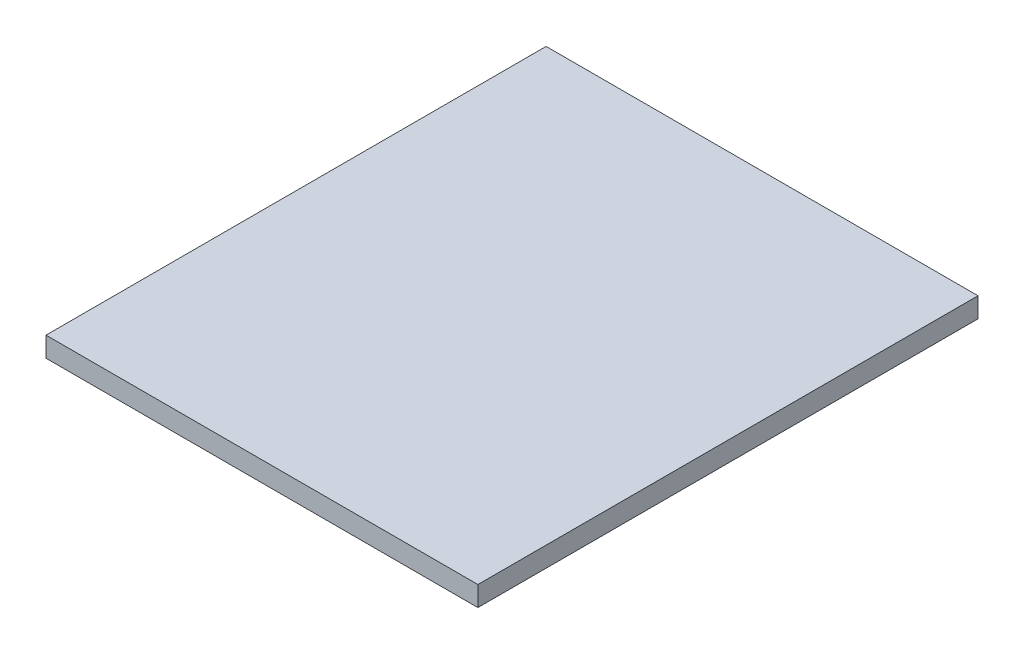
ISO-10303-21;
HEADER;
FILE_DESCRIPTION(('STEP AP214'),'2;1');
FILE_NAME('part.step','',(''),(''),'','','');
FILE_SCHEMA(('AUTOMOTIVE_DESIGN { 1 0 10303 214 1 1 1 1 }'));
ENDSEC;
DATA;
#1=APPLICATION_CONTEXT('core data for automotive mechanical design processes');
#2=APPLICATION_PROTOCOL_DEFINITION('international standard','automotive_design',2000,#1);
#3=PRODUCT_CONTEXT('',#1,'mechanical');
#4=PRODUCT('Part','Part','',(#3));
#5=PRODUCT_RELATED_PRODUCT_CATEGORY('part','',(#4));
#6=PRODUCT_DEFINITION_FORMATION('','',#4);
#7=PRODUCT_DEFINITION_CONTEXT('part definition',#1,'design');
#8=PRODUCT_DEFINITION('design','',#6,#7);
#9=PRODUCT_DEFINITION_SHAPE('','',#8);
#10=(LENGTH_UNIT() NAMED_UNIT(*) SI_UNIT(.MILLI.,.METRE.));
#11=(NAMED_UNIT(*) PLANE_ANGLE_UNIT() SI_UNIT($,.RADIAN.));
#12=(NAMED_UNIT(*) SI_UNIT($,.STERADIAN.) SOLID_ANGLE_UNIT());
#13=UNCERTAINTY_MEASURE_WITH_UNIT(LENGTH_MEASURE(1.E-05),#10,'distance_accuracy_value','');
#14=(GEOMETRIC_REPRESENTATION_CONTEXT(3) GLOBAL_UNCERTAINTY_ASSIGNED_CONTEXT((#13)) GLOBAL_UNIT_ASSIGNED_CONTEXT((#10,
#11,#12)) REPRESENTATION_CONTEXT('',''));
#15=CARTESIAN_POINT('',(0.,0.,0.));
#16=DIRECTION('',(0.,0.,1.));
#17=DIRECTION('',(1.,0.,0.));
#18=AXIS2_PLACEMENT_3D('',#15,#16,#17);
#19=CARTESIAN_POINT('',(215.9,0.,0.));
#20=DIRECTION('',(0.,0.,-1.));
#21=DIRECTION('',(0.,1.,0.));
#22=AXIS2_PLACEMENT_3D('',#19,#20,#21);
#23=PLANE('',#22);
#24=DIRECTION('',(0.,-1.,0.));
#25=VECTOR('',#24,1.);
#26=CARTESIAN_POINT('',(-215.9,0.,0.));
#27=LINE('',#26,#25);
#28=CARTESIAN_POINT('',(-215.9,0.,0.));
#29=VERTEX_POINT('',#28);
#30=CARTESIAN_POINT('',(-215.9,-20.,0.));
#31=VERTEX_POINT('',#30);
#32=EDGE_CURVE('E97',#29,#31,#27,.T.);
#33=ORIENTED_EDGE('',*,*,#32,.F.);
#34=DIRECTION('',(-1.,0.,0.));
#35=VECTOR('',#34,1.);
#36=CARTESIAN_POINT('',(215.9,0.,0.));
#37=LINE('',#36,#35);
#38=CARTESIAN_POINT('',(215.9,0.,0.));
#39=VERTEX_POINT('',#38);
#40=EDGE_CURVE('E11',#39,#29,#37,.T.);
#41=ORIENTED_EDGE('',*,*,#40,.F.);
#42=DIRECTION('',(0.,-1.,0.));
#43=VECTOR('',#42,1.);
#44=CARTESIAN_POINT('',(215.9,0.,0.));
#45=LINE('',#44,#43);
#46=CARTESIAN_POINT('',(215.9,-20.,0.));
#47=VERTEX_POINT('',#46);
#48=EDGE_CURVE('E92',#39,#47,#45,.T.);
#49=ORIENTED_EDGE('',*,*,#48,.T.);
#50=DIRECTION('',(-1.,0.,0.));
#51=VECTOR('',#50,1.);
#52=CARTESIAN_POINT('',(215.9,-20.,0.));
#53=LINE('',#52,#51);
#54=EDGE_CURVE('E35',#47,#31,#53,.T.);
#55=ORIENTED_EDGE('',*,*,#54,.T.);
#56=EDGE_LOOP('',(#33,#41,#49,#55));
#57=FACE_BOUND('',#56,.T.);
#58=ADVANCED_FACE('F32',(#57),#23,.T.);
#59=CARTESIAN_POINT('',(215.9,0.,0.));
#60=DIRECTION('',(0.,-1.,0.));
#61=DIRECTION('',(0.,0.,-1.));
#62=AXIS2_PLACEMENT_3D('',#59,#60,#61);
#63=PLANE('',#62);
#64=DIRECTION('',(0.,0.,1.));
#65=VECTOR('',#64,1.);
#66=CARTESIAN_POINT('',(-215.9,0.,0.));
#67=LINE('',#66,#65);
#68=CARTESIAN_POINT('',(-215.9,0.,500.));
#69=VERTEX_POINT('',#68);
#70=EDGE_CURVE('E65',#29,#69,#67,.T.);
#71=ORIENTED_EDGE('',*,*,#70,.T.);
#72=DIRECTION('',(-1.,0.,0.));
#73=VECTOR('',#72,1.);
#74=CARTESIAN_POINT('',(215.9,0.,500.));
#75=LINE('',#74,#73);
#76=CARTESIAN_POINT('',(215.9,0.,500.));
#77=VERTEX_POINT('',#76);
#78=EDGE_CURVE('E41',#77,#69,#75,.T.);
#79=ORIENTED_EDGE('',*,*,#78,.F.);
#80=DIRECTION('',(0.,0.,1.));
#81=VECTOR('',#80,1.);
#82=CARTESIAN_POINT('',(215.9,0.,0.));
#83=LINE('',#82,#81);
#84=EDGE_CURVE('E82',#39,#77,#83,.T.);
#85=ORIENTED_EDGE('',*,*,#84,.F.);
#86=ORIENTED_EDGE('',*,*,#40,.T.);
#87=EDGE_LOOP('',(#71,#79,#85,#86));
#88=FACE_BOUND('',#87,.T.);
#89=ADVANCED_FACE('F107',(#88),#63,.F.);
#90=CARTESIAN_POINT('',(215.9,0.,500.));
#91=DIRECTION('',(0.,0.,-1.));
#92=DIRECTION('',(-1.,0.,0.));
#93=AXIS2_PLACEMENT_3D('',#90,#91,#92);
#94=PLANE('',#93);
#95=DIRECTION('',(0.,-1.,0.));
#96=VECTOR('',#95,1.);
#97=CARTESIAN_POINT('',(-215.9,0.,500.));
#98=LINE('',#97,#96);
#99=CARTESIAN_POINT('',(-215.9,-20.0000000000002,500.));
#100=VERTEX_POINT('',#99);
#101=EDGE_CURVE('E89',#69,#100,#98,.T.);
#102=ORIENTED_EDGE('',*,*,#101,.T.);
#103=DIRECTION('',(-1.,0.,0.));
#104=VECTOR('',#103,1.);
#105=CARTESIAN_POINT('',(215.9,-20.0000000000002,500.));
#106=LINE('',#105,#104);
#107=CARTESIAN_POINT('',(215.9,-20.0000000000002,500.));
#108=VERTEX_POINT('',#107);
#109=EDGE_CURVE('E86',#108,#100,#106,.T.);
#110=ORIENTED_EDGE('',*,*,#109,.F.);
#111=DIRECTION('',(0.,-1.,0.));
#112=VECTOR('',#111,1.);
#113=CARTESIAN_POINT('',(215.9,0.,500.));
#114=LINE('',#113,#112);
#115=EDGE_CURVE('E77',#77,#108,#114,.T.);
#116=ORIENTED_EDGE('',*,*,#115,.F.);
#117=ORIENTED_EDGE('',*,*,#78,.T.);
#118=EDGE_LOOP('',(#102,#110,#116,#117));
#119=FACE_BOUND('',#118,.T.);
#120=ADVANCED_FACE('F87',(#119),#94,.F.);
#121=CARTESIAN_POINT('',(215.9,-20.,0.));
#122=DIRECTION('',(0.,-1.,0.));
#123=DIRECTION('',(0.,0.,-1.));
#124=AXIS2_PLACEMENT_3D('',#121,#122,#123);
#125=PLANE('',#124);
#126=DIRECTION('',(0.,0.,1.));
#127=VECTOR('',#126,1.);
#128=CARTESIAN_POINT('',(-215.9,-20.,0.));
#129=LINE('',#128,#127);
#130=EDGE_CURVE('E100',#31,#100,#129,.T.);
#131=ORIENTED_EDGE('',*,*,#130,.F.);
#132=ORIENTED_EDGE('',*,*,#54,.F.);
#133=DIRECTION('',(0.,0.,1.));
#134=VECTOR('',#133,1.);
#135=CARTESIAN_POINT('',(215.9,-20.,0.));
#136=LINE('',#135,#134);
#137=EDGE_CURVE('E81',#47,#108,#136,.T.);
#138=ORIENTED_EDGE('',*,*,#137,.T.);
#139=ORIENTED_EDGE('',*,*,#109,.T.);
#140=EDGE_LOOP('',(#131,#132,#138,#139));
#141=FACE_BOUND('',#140,.T.);
#142=ADVANCED_FACE('F91',(#141),#125,.T.);
#143=CARTESIAN_POINT('',(215.9,0.,0.));
#144=DIRECTION('',(-1.,0.,0.));
#145=DIRECTION('',(0.,0.,1.));
#146=AXIS2_PLACEMENT_3D('',#143,#144,#145);
#147=PLANE('',#146);
#148=ORIENTED_EDGE('',*,*,#48,.F.);
#149=ORIENTED_EDGE('',*,*,#84,.T.);
#150=ORIENTED_EDGE('',*,*,#115,.T.);
#151=ORIENTED_EDGE('',*,*,#137,.F.);
#152=EDGE_LOOP('',(#148,#149,#150,#151));
#153=FACE_BOUND('',#152,.T.);
#154=ADVANCED_FACE('F80',(#153),#147,.F.);
#155=CARTESIAN_POINT('',(-215.9,0.,0.));
#156=DIRECTION('',(-1.,0.,0.));
#157=DIRECTION('',(0.,0.,1.));
#158=AXIS2_PLACEMENT_3D('',#155,#156,#157);
#159=PLANE('',#158);
#160=ORIENTED_EDGE('',*,*,#32,.T.);
#161=ORIENTED_EDGE('',*,*,#130,.T.);
#162=ORIENTED_EDGE('',*,*,#101,.F.);
#163=ORIENTED_EDGE('',*,*,#70,.F.);
#164=EDGE_LOOP('',(#160,#161,#162,#163));
#165=FACE_BOUND('',#164,.T.);
#166=ADVANCED_FACE('F105',(#165),#159,.T.);
#167=CLOSED_SHELL('',(#58,#89,#120,#142,#154,#166));
#168=MANIFOLD_SOLID_BREP('B2',#167);
#169=ADVANCED_BREP_SHAPE_REPRESENTATION('',(#18,#168),#14);
#170=SHAPE_DEFINITION_REPRESENTATION(#9,#169);
ENDSEC;
END-ISO-10303-21;
